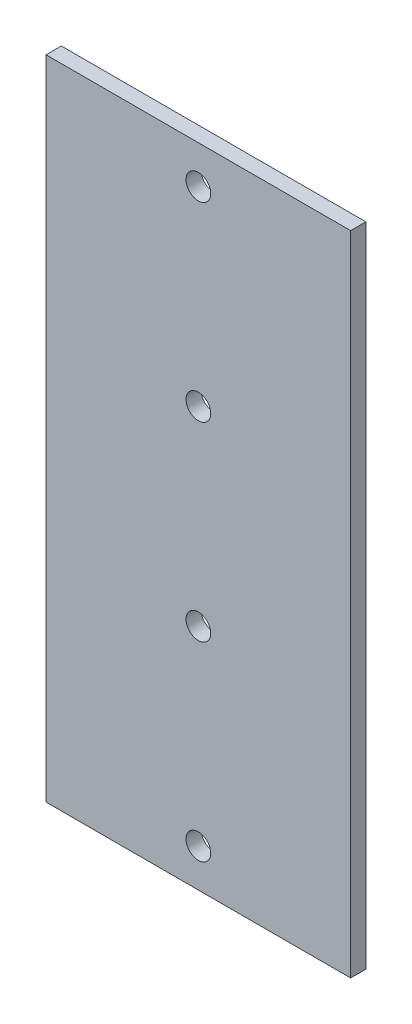
ISO-10303-21;
HEADER;
FILE_DESCRIPTION(('STEP AP214'),'2;1');
FILE_NAME('part.step','',(''),(''),'','','');
FILE_SCHEMA(('AUTOMOTIVE_DESIGN { 1 0 10303 214 1 1 1 1 }'));
ENDSEC;
DATA;
#1=APPLICATION_CONTEXT('core data for automotive mechanical design processes');
#2=APPLICATION_PROTOCOL_DEFINITION('international standard','automotive_design',2000,#1);
#3=PRODUCT_CONTEXT('',#1,'mechanical');
#4=PRODUCT('Part','Part','',(#3));
#5=PRODUCT_RELATED_PRODUCT_CATEGORY('part','',(#4));
#6=PRODUCT_DEFINITION_FORMATION('','',#4);
#7=PRODUCT_DEFINITION_CONTEXT('part definition',#1,'design');
#8=PRODUCT_DEFINITION('design','',#6,#7);
#9=PRODUCT_DEFINITION_SHAPE('','',#8);
#10=(LENGTH_UNIT() NAMED_UNIT(*) SI_UNIT(.MILLI.,.METRE.));
#11=(NAMED_UNIT(*) PLANE_ANGLE_UNIT() SI_UNIT($,.RADIAN.));
#12=(NAMED_UNIT(*) SI_UNIT($,.STERADIAN.) SOLID_ANGLE_UNIT());
#13=UNCERTAINTY_MEASURE_WITH_UNIT(LENGTH_MEASURE(1.E-05),#10,'distance_accuracy_value','');
#14=(GEOMETRIC_REPRESENTATION_CONTEXT(3) GLOBAL_UNCERTAINTY_ASSIGNED_CONTEXT((#13)) GLOBAL_UNIT_ASSIGNED_CONTEXT((#10,
#11,#12)) REPRESENTATION_CONTEXT('',''));
#15=CARTESIAN_POINT('',(0.,0.,0.));
#16=DIRECTION('',(0.,0.,1.));
#17=DIRECTION('',(1.,0.,0.));
#18=AXIS2_PLACEMENT_3D('',#15,#16,#17);
#19=CARTESIAN_POINT('',(0.,-37.5,1.));
#20=DIRECTION('',(0.,0.,-1.));
#21=DIRECTION('',(-1.,0.,0.));
#22=AXIS2_PLACEMENT_3D('',#19,#20,#21);
#23=CYLINDRICAL_SURFACE('',#22,1.625);
#24=CARTESIAN_POINT('',(0.,-37.5,1.));
#25=DIRECTION('',(0.,0.,-1.));
#26=DIRECTION('',(-1.,0.,0.));
#27=AXIS2_PLACEMENT_3D('',#24,#25,#26);
#28=CIRCLE('',#27,1.625);
#29=CARTESIAN_POINT('',(-1.625,-37.5,1.));
#30=VERTEX_POINT('',#29);
#31=EDGE_CURVE('E41',#30,#30,#28,.T.);
#32=ORIENTED_EDGE('',*,*,#31,.F.);
#33=EDGE_LOOP('',(#32));
#34=FACE_BOUND('',#33,.T.);
#35=CARTESIAN_POINT('',(0.,-37.5,-1.));
#36=DIRECTION('',(0.,0.,-1.));
#37=DIRECTION('',(-1.,0.,0.));
#38=AXIS2_PLACEMENT_3D('',#35,#36,#37);
#39=CIRCLE('',#38,1.625);
#40=CARTESIAN_POINT('',(-1.625,-37.5,-1.));
#41=VERTEX_POINT('',#40);
#42=EDGE_CURVE('E11',#41,#41,#39,.T.);
#43=ORIENTED_EDGE('',*,*,#42,.T.);
#44=EDGE_LOOP('',(#43));
#45=FACE_BOUND('',#44,.T.);
#46=ADVANCED_FACE('F33',(#34,#45),#23,.F.);
#47=CARTESIAN_POINT('',(0.,-12.5,1.));
#48=DIRECTION('',(0.,0.,-1.));
#49=DIRECTION('',(-1.,0.,0.));
#50=AXIS2_PLACEMENT_3D('',#47,#48,#49);
#51=CYLINDRICAL_SURFACE('',#50,1.625);
#52=CARTESIAN_POINT('',(0.,-12.5,1.));
#53=DIRECTION('',(0.,0.,-1.));
#54=DIRECTION('',(-1.,0.,0.));
#55=AXIS2_PLACEMENT_3D('',#52,#53,#54);
#56=CIRCLE('',#55,1.625);
#57=CARTESIAN_POINT('',(-1.625,-12.5,1.));
#58=VERTEX_POINT('',#57);
#59=EDGE_CURVE('E111',#58,#58,#56,.T.);
#60=ORIENTED_EDGE('',*,*,#59,.F.);
#61=EDGE_LOOP('',(#60));
#62=FACE_BOUND('',#61,.T.);
#63=CARTESIAN_POINT('',(0.,-12.5,-1.));
#64=DIRECTION('',(0.,0.,-1.));
#65=DIRECTION('',(-1.,0.,0.));
#66=AXIS2_PLACEMENT_3D('',#63,#64,#65);
#67=CIRCLE('',#66,1.625);
#68=CARTESIAN_POINT('',(-1.625,-12.5,-1.));
#69=VERTEX_POINT('',#68);
#70=EDGE_CURVE('E114',#69,#69,#67,.T.);
#71=ORIENTED_EDGE('',*,*,#70,.T.);
#72=EDGE_LOOP('',(#71));
#73=FACE_BOUND('',#72,.T.);
#74=ADVANCED_FACE('F122',(#62,#73),#51,.F.);
#75=CARTESIAN_POINT('',(20.,-42.5,1.));
#76=DIRECTION('',(-1.,0.,0.));
#77=DIRECTION('',(0.,0.,1.));
#78=AXIS2_PLACEMENT_3D('',#75,#76,#77);
#79=PLANE('',#78);
#80=DIRECTION('',(0.,1.,0.));
#81=VECTOR('',#80,1.);
#82=CARTESIAN_POINT('',(20.,-42.5,-1.));
#83=LINE('',#82,#81);
#84=CARTESIAN_POINT('',(20.,-42.5,-1.));
#85=VERTEX_POINT('',#84);
#86=CARTESIAN_POINT('',(20.,42.5,-1.));
#87=VERTEX_POINT('',#86);
#88=EDGE_CURVE('E101',#85,#87,#83,.T.);
#89=ORIENTED_EDGE('',*,*,#88,.T.);
#90=DIRECTION('',(0.,0.,-1.));
#91=VECTOR('',#90,1.);
#92=CARTESIAN_POINT('',(20.,42.5,1.));
#93=LINE('',#92,#91);
#94=CARTESIAN_POINT('',(20.,42.5,1.));
#95=VERTEX_POINT('',#94);
#96=EDGE_CURVE('E92',#95,#87,#93,.T.);
#97=ORIENTED_EDGE('',*,*,#96,.F.);
#98=DIRECTION('',(0.,1.,0.));
#99=VECTOR('',#98,1.);
#100=CARTESIAN_POINT('',(20.,-42.5,1.));
#101=LINE('',#100,#99);
#102=CARTESIAN_POINT('',(20.,-42.5,1.));
#103=VERTEX_POINT('',#102);
#104=EDGE_CURVE('E86',#103,#95,#101,.T.);
#105=ORIENTED_EDGE('',*,*,#104,.F.);
#106=DIRECTION('',(0.,0.,-1.));
#107=VECTOR('',#106,1.);
#108=CARTESIAN_POINT('',(20.,-42.5,1.));
#109=LINE('',#108,#107);
#110=EDGE_CURVE('E97',#103,#85,#109,.T.);
#111=ORIENTED_EDGE('',*,*,#110,.T.);
#112=EDGE_LOOP('',(#89,#97,#105,#111));
#113=FACE_BOUND('',#112,.T.);
#114=ADVANCED_FACE('F149',(#113),#79,.F.);
#115=CARTESIAN_POINT('',(-20.,42.5,1.));
#116=DIRECTION('',(0.,-1.,0.));
#117=DIRECTION('',(0.,0.,-1.));
#118=AXIS2_PLACEMENT_3D('',#115,#116,#117);
#119=PLANE('',#118);
#120=DIRECTION('',(-1.,0.,0.));
#121=VECTOR('',#120,1.);
#122=CARTESIAN_POINT('',(-20.,42.5,-1.));
#123=LINE('',#122,#121);
#124=CARTESIAN_POINT('',(-20.,42.5,-1.));
#125=VERTEX_POINT('',#124);
#126=EDGE_CURVE('E91',#87,#125,#123,.T.);
#127=ORIENTED_EDGE('',*,*,#126,.T.);
#128=DIRECTION('',(0.,0.,-1.));
#129=VECTOR('',#128,1.);
#130=CARTESIAN_POINT('',(-20.,42.5,1.));
#131=LINE('',#130,#129);
#132=CARTESIAN_POINT('',(-20.,42.5,1.));
#133=VERTEX_POINT('',#132);
#134=EDGE_CURVE('E89',#133,#125,#131,.T.);
#135=ORIENTED_EDGE('',*,*,#134,.F.);
#136=DIRECTION('',(-1.,0.,0.));
#137=VECTOR('',#136,1.);
#138=CARTESIAN_POINT('',(-20.,42.5,1.));
#139=LINE('',#138,#137);
#140=EDGE_CURVE('E80',#95,#133,#139,.T.);
#141=ORIENTED_EDGE('',*,*,#140,.F.);
#142=ORIENTED_EDGE('',*,*,#96,.T.);
#143=EDGE_LOOP('',(#127,#135,#141,#142));
#144=FACE_BOUND('',#143,.T.);
#145=ADVANCED_FACE('F90',(#144),#119,.F.);
#146=CARTESIAN_POINT('',(-20.,-42.5,1.));
#147=DIRECTION('',(1.,0.,0.));
#148=DIRECTION('',(0.,0.,-1.));
#149=AXIS2_PLACEMENT_3D('',#146,#147,#148);
#150=PLANE('',#149);
#151=DIRECTION('',(0.,-1.,0.));
#152=VECTOR('',#151,1.);
#153=CARTESIAN_POINT('',(-20.,-42.5,-1.));
#154=LINE('',#153,#152);
#155=CARTESIAN_POINT('',(-20.,-42.5,-1.));
#156=VERTEX_POINT('',#155);
#157=EDGE_CURVE('E66',#125,#156,#154,.T.);
#158=ORIENTED_EDGE('',*,*,#157,.T.);
#159=DIRECTION('',(0.,0.,-1.));
#160=VECTOR('',#159,1.);
#161=CARTESIAN_POINT('',(-20.,-42.5,1.));
#162=LINE('',#161,#160);
#163=CARTESIAN_POINT('',(-20.,-42.5,1.));
#164=VERTEX_POINT('',#163);
#165=EDGE_CURVE('E93',#164,#156,#162,.T.);
#166=ORIENTED_EDGE('',*,*,#165,.F.);
#167=DIRECTION('',(0.,-1.,0.));
#168=VECTOR('',#167,1.);
#169=CARTESIAN_POINT('',(-20.,-42.5,1.));
#170=LINE('',#169,#168);
#171=EDGE_CURVE('E84',#133,#164,#170,.T.);
#172=ORIENTED_EDGE('',*,*,#171,.F.);
#173=ORIENTED_EDGE('',*,*,#134,.T.);
#174=EDGE_LOOP('',(#158,#166,#172,#173));
#175=FACE_BOUND('',#174,.T.);
#176=ADVANCED_FACE('F95',(#175),#150,.F.);
#177=CARTESIAN_POINT('',(-20.,-42.5,1.));
#178=DIRECTION('',(0.,1.,0.));
#179=DIRECTION('',(0.,0.,1.));
#180=AXIS2_PLACEMENT_3D('',#177,#178,#179);
#181=PLANE('',#180);
#182=DIRECTION('',(1.,0.,0.));
#183=VECTOR('',#182,1.);
#184=CARTESIAN_POINT('',(-20.,-42.5,-1.));
#185=LINE('',#184,#183);
#186=EDGE_CURVE('E72',#156,#85,#185,.T.);
#187=ORIENTED_EDGE('',*,*,#186,.T.);
#188=ORIENTED_EDGE('',*,*,#110,.F.);
#189=DIRECTION('',(1.,0.,0.));
#190=VECTOR('',#189,1.);
#191=CARTESIAN_POINT('',(-20.,-42.5,1.));
#192=LINE('',#191,#190);
#193=EDGE_CURVE('E49',#164,#103,#192,.T.);
#194=ORIENTED_EDGE('',*,*,#193,.F.);
#195=ORIENTED_EDGE('',*,*,#165,.T.);
#196=EDGE_LOOP('',(#187,#188,#194,#195));
#197=FACE_BOUND('',#196,.T.);
#198=ADVANCED_FACE('F137',(#197),#181,.F.);
#199=CARTESIAN_POINT('',(0.,0.,1.));
#200=DIRECTION('',(0.,0.,-1.));
#201=DIRECTION('',(-1.,0.,0.));
#202=AXIS2_PLACEMENT_3D('',#199,#200,#201);
#203=PLANE('',#202);
#204=CARTESIAN_POINT('',(0.,12.5,1.));
#205=DIRECTION('',(0.,0.,-1.));
#206=DIRECTION('',(-1.,0.,0.));
#207=AXIS2_PLACEMENT_3D('',#204,#205,#206);
#208=CIRCLE('',#207,1.625);
#209=CARTESIAN_POINT('',(-1.625,12.5,1.));
#210=VERTEX_POINT('',#209);
#211=EDGE_CURVE('E214',#210,#210,#208,.T.);
#212=ORIENTED_EDGE('',*,*,#211,.T.);
#213=EDGE_LOOP('',(#212));
#214=FACE_BOUND('',#213,.T.);
#215=CARTESIAN_POINT('',(0.,37.5,1.));
#216=DIRECTION('',(0.,0.,-1.));
#217=DIRECTION('',(-1.,0.,0.));
#218=AXIS2_PLACEMENT_3D('',#215,#216,#217);
#219=CIRCLE('',#218,1.625);
#220=CARTESIAN_POINT('',(-1.625,37.5,1.));
#221=VERTEX_POINT('',#220);
#222=EDGE_CURVE('E104',#221,#221,#219,.T.);
#223=ORIENTED_EDGE('',*,*,#222,.T.);
#224=EDGE_LOOP('',(#223));
#225=FACE_BOUND('',#224,.T.);
#226=ORIENTED_EDGE('',*,*,#104,.T.);
#227=ORIENTED_EDGE('',*,*,#140,.T.);
#228=ORIENTED_EDGE('',*,*,#171,.T.);
#229=ORIENTED_EDGE('',*,*,#193,.T.);
#230=EDGE_LOOP('',(#226,#227,#228,#229));
#231=FACE_BOUND('',#230,.T.);
#232=ORIENTED_EDGE('',*,*,#59,.T.);
#233=EDGE_LOOP('',(#232));
#234=FACE_BOUND('',#233,.T.);
#235=ORIENTED_EDGE('',*,*,#31,.T.);
#236=EDGE_LOOP('',(#235));
#237=FACE_BOUND('',#236,.T.);
#238=ADVANCED_FACE('F81',(#214,#225,#231,#234,#237),#203,.F.);
#239=CARTESIAN_POINT('',(0.,0.,-1.));
#240=DIRECTION('',(0.,0.,-1.));
#241=DIRECTION('',(-1.,0.,0.));
#242=AXIS2_PLACEMENT_3D('',#239,#240,#241);
#243=PLANE('',#242);
#244=CARTESIAN_POINT('',(0.,12.5,-1.));
#245=DIRECTION('',(0.,0.,-1.));
#246=DIRECTION('',(-1.,0.,0.));
#247=AXIS2_PLACEMENT_3D('',#244,#245,#246);
#248=CIRCLE('',#247,1.625);
#249=CARTESIAN_POINT('',(-1.625,12.5,-1.));
#250=VERTEX_POINT('',#249);
#251=EDGE_CURVE('E216',#250,#250,#248,.T.);
#252=ORIENTED_EDGE('',*,*,#251,.F.);
#253=EDGE_LOOP('',(#252));
#254=FACE_BOUND('',#253,.T.);
#255=CARTESIAN_POINT('',(0.,37.5,-1.));
#256=DIRECTION('',(0.,0.,-1.));
#257=DIRECTION('',(-1.,0.,0.));
#258=AXIS2_PLACEMENT_3D('',#255,#256,#257);
#259=CIRCLE('',#258,1.625);
#260=CARTESIAN_POINT('',(-1.625,37.5,-1.));
#261=VERTEX_POINT('',#260);
#262=EDGE_CURVE('E217',#261,#261,#259,.T.);
#263=ORIENTED_EDGE('',*,*,#262,.F.);
#264=EDGE_LOOP('',(#263));
#265=FACE_BOUND('',#264,.T.);
#266=ORIENTED_EDGE('',*,*,#88,.F.);
#267=ORIENTED_EDGE('',*,*,#186,.F.);
#268=ORIENTED_EDGE('',*,*,#157,.F.);
#269=ORIENTED_EDGE('',*,*,#126,.F.);
#270=EDGE_LOOP('',(#266,#267,#268,#269));
#271=FACE_BOUND('',#270,.T.);
#272=ORIENTED_EDGE('',*,*,#70,.F.);
#273=EDGE_LOOP('',(#272));
#274=FACE_BOUND('',#273,.T.);
#275=ORIENTED_EDGE('',*,*,#42,.F.);
#276=EDGE_LOOP('',(#275));
#277=FACE_BOUND('',#276,.T.);
#278=ADVANCED_FACE('F125',(#254,#265,#271,#274,#277),#243,.T.);
#279=CARTESIAN_POINT('',(0.,37.5,1.));
#280=DIRECTION('',(0.,0.,-1.));
#281=DIRECTION('',(-1.,0.,0.));
#282=AXIS2_PLACEMENT_3D('',#279,#280,#281);
#283=CYLINDRICAL_SURFACE('',#282,1.625);
#284=ORIENTED_EDGE('',*,*,#222,.F.);
#285=EDGE_LOOP('',(#284));
#286=FACE_BOUND('',#285,.T.);
#287=ORIENTED_EDGE('',*,*,#262,.T.);
#288=EDGE_LOOP('',(#287));
#289=FACE_BOUND('',#288,.T.);
#290=ADVANCED_FACE('F127',(#286,#289),#283,.F.);
#291=CARTESIAN_POINT('',(0.,12.5,1.));
#292=DIRECTION('',(0.,0.,-1.));
#293=DIRECTION('',(-1.,0.,0.));
#294=AXIS2_PLACEMENT_3D('',#291,#292,#293);
#295=CYLINDRICAL_SURFACE('',#294,1.625);
#296=ORIENTED_EDGE('',*,*,#211,.F.);
#297=EDGE_LOOP('',(#296));
#298=FACE_BOUND('',#297,.T.);
#299=ORIENTED_EDGE('',*,*,#251,.T.);
#300=EDGE_LOOP('',(#299));
#301=FACE_BOUND('',#300,.T.);
#302=ADVANCED_FACE('F134',(#298,#301),#295,.F.);
#303=CLOSED_SHELL('',(#46,#74,#114,#145,#176,#198,#238,#278,#290,#302));
#304=MANIFOLD_SOLID_BREP('B2',#303);
#305=ADVANCED_BREP_SHAPE_REPRESENTATION('',(#18,#304),#14);
#306=SHAPE_DEFINITION_REPRESENTATION(#9,#305);
ENDSEC;
END-ISO-10303-21;
